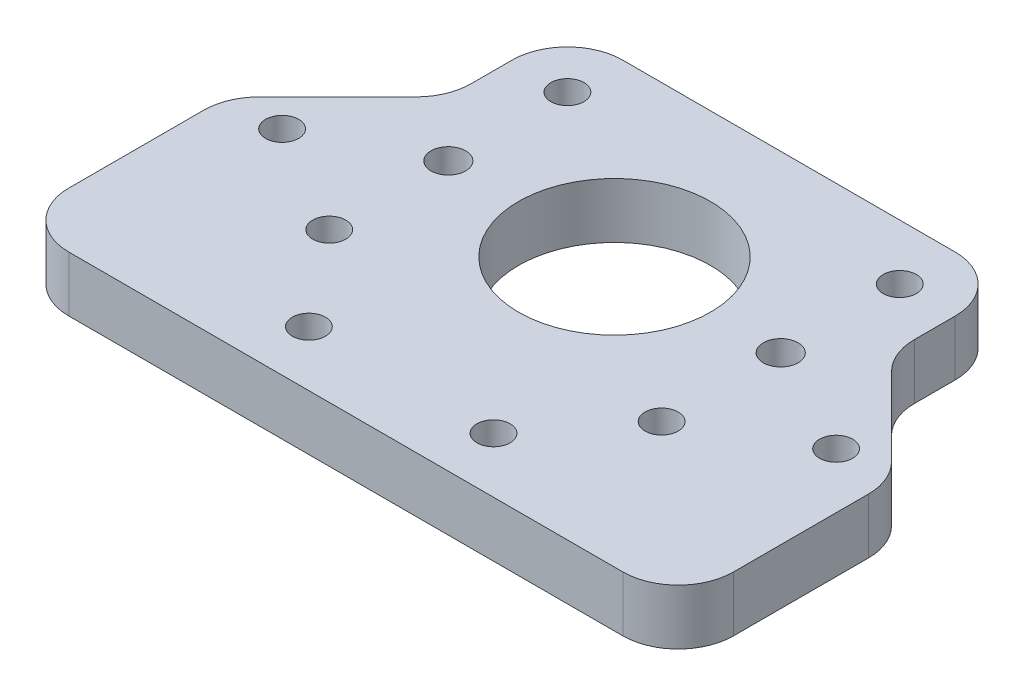
ISO-10303-21;
HEADER;
FILE_DESCRIPTION(('STEP AP214'),'2;1');
FILE_NAME('part.step','',(''),(''),'','','');
FILE_SCHEMA(('AUTOMOTIVE_DESIGN { 1 0 10303 214 1 1 1 1 }'));
ENDSEC;
DATA;
#1=APPLICATION_CONTEXT('core data for automotive mechanical design processes');
#2=APPLICATION_PROTOCOL_DEFINITION('international standard','automotive_design',2000,#1);
#3=PRODUCT_CONTEXT('',#1,'mechanical');
#4=PRODUCT('Part','Part','',(#3));
#5=PRODUCT_RELATED_PRODUCT_CATEGORY('part','',(#4));
#6=PRODUCT_DEFINITION_FORMATION('','',#4);
#7=PRODUCT_DEFINITION_CONTEXT('part definition',#1,'design');
#8=PRODUCT_DEFINITION('design','',#6,#7);
#9=PRODUCT_DEFINITION_SHAPE('','',#8);
#10=(LENGTH_UNIT() NAMED_UNIT(*) SI_UNIT(.MILLI.,.METRE.));
#11=(NAMED_UNIT(*) PLANE_ANGLE_UNIT() SI_UNIT($,.RADIAN.));
#12=(NAMED_UNIT(*) SI_UNIT($,.STERADIAN.) SOLID_ANGLE_UNIT());
#13=UNCERTAINTY_MEASURE_WITH_UNIT(LENGTH_MEASURE(1.E-05),#10,'distance_accuracy_value','');
#14=(GEOMETRIC_REPRESENTATION_CONTEXT(3) GLOBAL_UNCERTAINTY_ASSIGNED_CONTEXT((#13)) GLOBAL_UNIT_ASSIGNED_CONTEXT((#10,
#11,#12)) REPRESENTATION_CONTEXT('',''));
#15=CARTESIAN_POINT('',(0.,0.,0.));
#16=DIRECTION('',(0.,0.,1.));
#17=DIRECTION('',(1.,0.,0.));
#18=AXIS2_PLACEMENT_3D('',#15,#16,#17);
#19=CARTESIAN_POINT('',(0.,6.35,-50.8));
#20=DIRECTION('',(0.,-1.,0.));
#21=DIRECTION('',(0.,0.,-1.));
#22=AXIS2_PLACEMENT_3D('',#19,#20,#21);
#23=PLANE('',#22);
#24=CARTESIAN_POINT('',(6.34999999999999,6.35,-24.45004));
#25=DIRECTION('',(0.,-1.,0.));
#26=DIRECTION('',(0.,0.,-1.));
#27=AXIS2_PLACEMENT_3D('',#24,#25,#26);
#28=CIRCLE('',#27,1.89865);
#29=CARTESIAN_POINT('',(6.34999999999999,6.35,-26.34869));
#30=VERTEX_POINT('',#29);
#31=EDGE_CURVE('E188',#30,#30,#28,.T.);
#32=ORIENTED_EDGE('',*,*,#31,.T.);
#33=EDGE_LOOP('',(#32));
#34=FACE_BOUND('',#33,.T.);
#35=CARTESIAN_POINT('',(27.5166666666667,6.35,-6.35));
#36=DIRECTION('',(0.,-1.,0.));
#37=DIRECTION('',(0.,0.,-1.));
#38=AXIS2_PLACEMENT_3D('',#35,#36,#37);
#39=CIRCLE('',#38,1.89865);
#40=CARTESIAN_POINT('',(27.5166666666667,6.35,-8.24865));
#41=VERTEX_POINT('',#40);
#42=EDGE_CURVE('E195',#41,#41,#39,.T.);
#43=ORIENTED_EDGE('',*,*,#42,.T.);
#44=EDGE_LOOP('',(#43));
#45=FACE_BOUND('',#44,.T.);
#46=CARTESIAN_POINT('',(48.6833333333333,6.35,-6.35));
#47=DIRECTION('',(0.,-1.,0.));
#48=DIRECTION('',(0.,0.,-1.));
#49=AXIS2_PLACEMENT_3D('',#46,#47,#48);
#50=CIRCLE('',#49,1.89865);
#51=CARTESIAN_POINT('',(48.6833333333333,6.35,-8.24865));
#52=VERTEX_POINT('',#51);
#53=EDGE_CURVE('E201',#52,#52,#50,.T.);
#54=ORIENTED_EDGE('',*,*,#53,.T.);
#55=EDGE_LOOP('',(#54));
#56=FACE_BOUND('',#55,.T.);
#57=CARTESIAN_POINT('',(69.85,6.35,-24.45004));
#58=DIRECTION('',(0.,-1.,0.));
#59=DIRECTION('',(0.,0.,-1.));
#60=AXIS2_PLACEMENT_3D('',#57,#58,#59);
#61=CIRCLE('',#60,1.89865000000001);
#62=CARTESIAN_POINT('',(69.85,6.35,-26.34869));
#63=VERTEX_POINT('',#62);
#64=EDGE_CURVE('E207',#63,#63,#61,.T.);
#65=ORIENTED_EDGE('',*,*,#64,.T.);
#66=EDGE_LOOP('',(#65));
#67=FACE_BOUND('',#66,.T.);
#68=CARTESIAN_POINT('',(57.15,6.35,-17.15));
#69=DIRECTION('',(0.,-1.,0.));
#70=DIRECTION('',(0.,0.,-1.));
#71=AXIS2_PLACEMENT_3D('',#68,#69,#70);
#72=CIRCLE('',#71,1.89865);
#73=CARTESIAN_POINT('',(57.15,6.35,-19.04865));
#74=VERTEX_POINT('',#73);
#75=EDGE_CURVE('E213',#74,#74,#72,.T.);
#76=ORIENTED_EDGE('',*,*,#75,.T.);
#77=EDGE_LOOP('',(#76));
#78=FACE_BOUND('',#77,.T.);
#79=CARTESIAN_POINT('',(19.05,6.35,-17.15));
#80=DIRECTION('',(0.,-1.,0.));
#81=DIRECTION('',(0.,0.,-1.));
#82=AXIS2_PLACEMENT_3D('',#79,#80,#81);
#83=CIRCLE('',#82,1.89865);
#84=CARTESIAN_POINT('',(19.05,6.35,-19.04865));
#85=VERTEX_POINT('',#84);
#86=EDGE_CURVE('E219',#85,#85,#83,.T.);
#87=ORIENTED_EDGE('',*,*,#86,.T.);
#88=EDGE_LOOP('',(#87));
#89=FACE_BOUND('',#88,.T.);
#90=CARTESIAN_POINT('',(19.05,6.35,-44.45));
#91=DIRECTION('',(0.,-1.,0.));
#92=DIRECTION('',(0.,0.,-1.));
#93=AXIS2_PLACEMENT_3D('',#90,#91,#92);
#94=CIRCLE('',#93,1.89865);
#95=CARTESIAN_POINT('',(19.05,6.35,-46.34865));
#96=VERTEX_POINT('',#95);
#97=EDGE_CURVE('E225',#96,#96,#94,.T.);
#98=ORIENTED_EDGE('',*,*,#97,.T.);
#99=EDGE_LOOP('',(#98));
#100=FACE_BOUND('',#99,.T.);
#101=CARTESIAN_POINT('',(57.15,6.35,-44.45));
#102=DIRECTION('',(0.,-1.,0.));
#103=DIRECTION('',(0.,0.,-1.));
#104=AXIS2_PLACEMENT_3D('',#101,#102,#103);
#105=CIRCLE('',#104,1.89865);
#106=CARTESIAN_POINT('',(57.15,6.35,-46.34865));
#107=VERTEX_POINT('',#106);
#108=EDGE_CURVE('E231',#107,#107,#105,.T.);
#109=ORIENTED_EDGE('',*,*,#108,.T.);
#110=EDGE_LOOP('',(#109));
#111=FACE_BOUND('',#110,.T.);
#112=CARTESIAN_POINT('',(57.15,6.35,-30.8));
#113=DIRECTION('',(0.,1.,0.));
#114=DIRECTION('',(0.,0.,-1.));
#115=AXIS2_PLACEMENT_3D('',#112,#113,#114);
#116=CIRCLE('',#115,1.9939);
#117=CARTESIAN_POINT('',(57.15,6.35,-32.7939));
#118=VERTEX_POINT('',#117);
#119=EDGE_CURVE('E234',#118,#118,#116,.T.);
#120=ORIENTED_EDGE('',*,*,#119,.F.);
#121=EDGE_LOOP('',(#120));
#122=FACE_BOUND('',#121,.T.);
#123=CARTESIAN_POINT('',(19.05,6.35,-30.8));
#124=DIRECTION('',(0.,1.,0.));
#125=DIRECTION('',(0.,0.,1.));
#126=AXIS2_PLACEMENT_3D('',#123,#124,#125);
#127=CIRCLE('',#126,1.9939);
#128=CARTESIAN_POINT('',(19.05,6.35,-28.8061));
#129=VERTEX_POINT('',#128);
#130=EDGE_CURVE('E240',#129,#129,#127,.T.);
#131=ORIENTED_EDGE('',*,*,#130,.F.);
#132=EDGE_LOOP('',(#131));
#133=FACE_BOUND('',#132,.T.);
#134=DIRECTION('',(0.707106781186549,0.,-0.707106781186546));
#135=VECTOR('',#134,1.);
#136=CARTESIAN_POINT('',(12.7,6.35,-37.15));
#137=LINE('',#136,#135);
#138=CARTESIAN_POINT('',(1.85987193946543,6.35,-26.3098719394655));
#139=VERTEX_POINT('',#138);
#140=CARTESIAN_POINT('',(10.8401280605346,6.35,-35.2901280605346));
#141=VERTEX_POINT('',#140);
#142=EDGE_CURVE('E166',#139,#141,#137,.T.);
#143=ORIENTED_EDGE('',*,*,#142,.F.);
#144=CARTESIAN_POINT('',(6.35,6.35,-21.8197438789309));
#145=DIRECTION('',(0.,-1.,0.));
#146=DIRECTION('',(0.,0.,-1.));
#147=AXIS2_PLACEMENT_3D('',#144,#145,#146);
#148=CIRCLE('',#147,6.35);
#149=CARTESIAN_POINT('',(0.,6.35,-21.8197438789309));
#150=VERTEX_POINT('',#149);
#151=EDGE_CURVE('E149',#139,#150,#148,.F.);
#152=ORIENTED_EDGE('',*,*,#151,.T.);
#153=DIRECTION('',(0.,0.,1.));
#154=VECTOR('',#153,1.);
#155=CARTESIAN_POINT('',(0.,6.35,0.));
#156=LINE('',#155,#154);
#157=CARTESIAN_POINT('',(0.,6.35,-6.35));
#158=VERTEX_POINT('',#157);
#159=EDGE_CURVE('E255',#150,#158,#156,.T.);
#160=ORIENTED_EDGE('',*,*,#159,.T.);
#161=CARTESIAN_POINT('',(6.35,6.35,-6.35));
#162=DIRECTION('',(0.,-1.,0.));
#163=DIRECTION('',(0.,0.,-1.));
#164=AXIS2_PLACEMENT_3D('',#161,#162,#163);
#165=CIRCLE('',#164,6.35);
#166=CARTESIAN_POINT('',(6.35,6.35,0.));
#167=VERTEX_POINT('',#166);
#168=EDGE_CURVE('E170',#158,#167,#165,.F.);
#169=ORIENTED_EDGE('',*,*,#168,.T.);
#170=DIRECTION('',(1.,0.,0.));
#171=VECTOR('',#170,1.);
#172=CARTESIAN_POINT('',(0.,6.35,0.));
#173=LINE('',#172,#171);
#174=CARTESIAN_POINT('',(69.85,6.35,0.));
#175=VERTEX_POINT('',#174);
#176=EDGE_CURVE('E257',#167,#175,#173,.T.);
#177=ORIENTED_EDGE('',*,*,#176,.T.);
#178=CARTESIAN_POINT('',(69.85,6.35,-6.35));
#179=DIRECTION('',(0.,-1.,0.));
#180=DIRECTION('',(0.,0.,-1.));
#181=AXIS2_PLACEMENT_3D('',#178,#179,#180);
#182=CIRCLE('',#181,6.35);
#183=CARTESIAN_POINT('',(76.2,6.35,-6.35));
#184=VERTEX_POINT('',#183);
#185=EDGE_CURVE('E279',#175,#184,#182,.F.);
#186=ORIENTED_EDGE('',*,*,#185,.T.);
#187=DIRECTION('',(0.,0.,-1.));
#188=VECTOR('',#187,1.);
#189=CARTESIAN_POINT('',(76.2,6.35,-50.8));
#190=LINE('',#189,#188);
#191=CARTESIAN_POINT('',(76.2,6.35,-21.8197438789309));
#192=VERTEX_POINT('',#191);
#193=EDGE_CURVE('E261',#184,#192,#190,.T.);
#194=ORIENTED_EDGE('',*,*,#193,.T.);
#195=CARTESIAN_POINT('',(69.85,6.35,-21.8197438789309));
#196=DIRECTION('',(0.,-1.,0.));
#197=DIRECTION('',(0.,0.,-1.));
#198=AXIS2_PLACEMENT_3D('',#195,#196,#197);
#199=CIRCLE('',#198,6.35);
#200=CARTESIAN_POINT('',(74.3401280605346,6.35,-26.3098719394655));
#201=VERTEX_POINT('',#200);
#202=EDGE_CURVE('E160',#192,#201,#199,.F.);
#203=ORIENTED_EDGE('',*,*,#202,.T.);
#204=DIRECTION('',(0.707106781186549,0.,0.707106781186546));
#205=VECTOR('',#204,1.);
#206=CARTESIAN_POINT('',(76.2,6.35,-24.4500000000001));
#207=LINE('',#206,#205);
#208=CARTESIAN_POINT('',(65.3598719394654,6.35,-35.2901280605346));
#209=VERTEX_POINT('',#208);
#210=EDGE_CURVE('E335',#209,#201,#207,.T.);
#211=ORIENTED_EDGE('',*,*,#210,.F.);
#212=CARTESIAN_POINT('',(69.85,6.35,-39.7802561210692));
#213=DIRECTION('',(0.,-1.,0.));
#214=DIRECTION('',(0.,0.,-1.));
#215=AXIS2_PLACEMENT_3D('',#212,#213,#214);
#216=CIRCLE('',#215,6.35);
#217=CARTESIAN_POINT('',(63.5,6.35,-39.7802561210692));
#218=VERTEX_POINT('',#217);
#219=EDGE_CURVE('E43',#209,#218,#216,.T.);
#220=ORIENTED_EDGE('',*,*,#219,.T.);
#221=DIRECTION('',(0.,0.,1.));
#222=VECTOR('',#221,1.);
#223=CARTESIAN_POINT('',(63.5,6.35,-50.8));
#224=LINE('',#223,#222);
#225=CARTESIAN_POINT('',(63.5,6.35,-44.45));
#226=VERTEX_POINT('',#225);
#227=EDGE_CURVE('E333',#226,#218,#224,.T.);
#228=ORIENTED_EDGE('',*,*,#227,.F.);
#229=CARTESIAN_POINT('',(57.15,6.35,-44.45));
#230=DIRECTION('',(0.,-1.,0.));
#231=DIRECTION('',(0.,0.,-1.));
#232=AXIS2_PLACEMENT_3D('',#229,#230,#231);
#233=CIRCLE('',#232,6.35);
#234=CARTESIAN_POINT('',(57.15,6.35,-50.8));
#235=VERTEX_POINT('',#234);
#236=EDGE_CURVE('E283',#226,#235,#233,.F.);
#237=ORIENTED_EDGE('',*,*,#236,.T.);
#238=DIRECTION('',(-1.,0.,0.));
#239=VECTOR('',#238,1.);
#240=CARTESIAN_POINT('',(38.1,6.35,-50.8));
#241=LINE('',#240,#239);
#242=CARTESIAN_POINT('',(19.05,6.35,-50.8));
#243=VERTEX_POINT('',#242);
#244=EDGE_CURVE('E264',#235,#243,#241,.T.);
#245=ORIENTED_EDGE('',*,*,#244,.T.);
#246=CARTESIAN_POINT('',(19.05,6.35,-44.45));
#247=DIRECTION('',(0.,-1.,0.));
#248=DIRECTION('',(0.,0.,-1.));
#249=AXIS2_PLACEMENT_3D('',#246,#247,#248);
#250=CIRCLE('',#249,6.35);
#251=CARTESIAN_POINT('',(12.7,6.35,-44.45));
#252=VERTEX_POINT('',#251);
#253=EDGE_CURVE('E281',#243,#252,#250,.F.);
#254=ORIENTED_EDGE('',*,*,#253,.T.);
#255=DIRECTION('',(0.,0.,-1.));
#256=VECTOR('',#255,1.);
#257=CARTESIAN_POINT('',(12.7,6.35,-50.8));
#258=LINE('',#257,#256);
#259=CARTESIAN_POINT('',(12.7,6.35,-39.7802561210692));
#260=VERTEX_POINT('',#259);
#261=EDGE_CURVE('E176',#260,#252,#258,.T.);
#262=ORIENTED_EDGE('',*,*,#261,.F.);
#263=CARTESIAN_POINT('',(6.35,6.35,-39.7802561210692));
#264=DIRECTION('',(0.,-1.,0.));
#265=DIRECTION('',(0.,0.,-1.));
#266=AXIS2_PLACEMENT_3D('',#263,#264,#265);
#267=CIRCLE('',#266,6.35);
#268=EDGE_CURVE('E175',#260,#141,#267,.T.);
#269=ORIENTED_EDGE('',*,*,#268,.T.);
#270=EDGE_LOOP('',(#143,#152,#160,#169,#177,#186,#194,#203,#211,#220,#228,#237,#245,#254,#262,#269));
#271=FACE_BOUND('',#270,.T.);
#272=CARTESIAN_POINT('',(38.1,6.35,-30.8));
#273=DIRECTION('',(0.,1.,0.));
#274=DIRECTION('',(0.,0.,1.));
#275=AXIS2_PLACEMENT_3D('',#272,#273,#274);
#276=CIRCLE('',#275,11.);
#277=CARTESIAN_POINT('',(38.1,6.35,-19.8));
#278=VERTEX_POINT('',#277);
#279=EDGE_CURVE('E249',#278,#278,#276,.T.);
#280=ORIENTED_EDGE('',*,*,#279,.F.);
#281=EDGE_LOOP('',(#280));
#282=FACE_BOUND('',#281,.T.);
#283=ADVANCED_FACE('F35',(#34,#45,#56,#67,#78,#89,#100,#111,#122,#133,#271,#282),#23,.F.);
#284=CARTESIAN_POINT('',(0.,0.,-50.8));
#285=DIRECTION('',(0.,-1.,0.));
#286=DIRECTION('',(0.,0.,-1.));
#287=AXIS2_PLACEMENT_3D('',#284,#285,#286);
#288=PLANE('',#287);
#289=DIRECTION('',(0.,0.,1.));
#290=VECTOR('',#289,1.);
#291=CARTESIAN_POINT('',(0.,0.,0.));
#292=LINE('',#291,#290);
#293=CARTESIAN_POINT('',(0.,0.,-21.8197438789309));
#294=VERTEX_POINT('',#293);
#295=CARTESIAN_POINT('',(0.,0.,-6.35));
#296=VERTEX_POINT('',#295);
#297=EDGE_CURVE('E252',#294,#296,#292,.T.);
#298=ORIENTED_EDGE('',*,*,#297,.F.);
#299=CARTESIAN_POINT('',(6.35,0.,-21.8197438789309));
#300=DIRECTION('',(0.,-1.,0.));
#301=DIRECTION('',(0.,0.,-1.));
#302=AXIS2_PLACEMENT_3D('',#299,#300,#301);
#303=CIRCLE('',#302,6.35);
#304=CARTESIAN_POINT('',(1.85987193946543,0.,-26.3098719394655));
#305=VERTEX_POINT('',#304);
#306=EDGE_CURVE('E297',#294,#305,#303,.T.);
#307=ORIENTED_EDGE('',*,*,#306,.T.);
#308=DIRECTION('',(0.707106781186549,0.,-0.707106781186546));
#309=VECTOR('',#308,1.);
#310=CARTESIAN_POINT('',(12.7,0.,-37.15));
#311=LINE('',#310,#309);
#312=CARTESIAN_POINT('',(10.8401280605346,0.,-35.2901280605346));
#313=VERTEX_POINT('',#312);
#314=EDGE_CURVE('E169',#305,#313,#311,.T.);
#315=ORIENTED_EDGE('',*,*,#314,.T.);
#316=CARTESIAN_POINT('',(6.35,0.,-39.7802561210692));
#317=DIRECTION('',(0.,-1.,0.));
#318=DIRECTION('',(0.,0.,-1.));
#319=AXIS2_PLACEMENT_3D('',#316,#317,#318);
#320=CIRCLE('',#319,6.35);
#321=CARTESIAN_POINT('',(12.7,0.,-39.7802561210692));
#322=VERTEX_POINT('',#321);
#323=EDGE_CURVE('E330',#313,#322,#320,.F.);
#324=ORIENTED_EDGE('',*,*,#323,.T.);
#325=DIRECTION('',(0.,0.,-1.));
#326=VECTOR('',#325,1.);
#327=CARTESIAN_POINT('',(12.7,0.,-50.8));
#328=LINE('',#327,#326);
#329=CARTESIAN_POINT('',(12.7,0.,-44.45));
#330=VERTEX_POINT('',#329);
#331=EDGE_CURVE('E185',#322,#330,#328,.T.);
#332=ORIENTED_EDGE('',*,*,#331,.T.);
#333=CARTESIAN_POINT('',(19.05,0.,-44.45));
#334=DIRECTION('',(0.,-1.,0.));
#335=DIRECTION('',(0.,0.,-1.));
#336=AXIS2_PLACEMENT_3D('',#333,#334,#335);
#337=CIRCLE('',#336,6.35);
#338=CARTESIAN_POINT('',(19.05,0.,-50.8));
#339=VERTEX_POINT('',#338);
#340=EDGE_CURVE('E292',#330,#339,#337,.T.);
#341=ORIENTED_EDGE('',*,*,#340,.T.);
#342=DIRECTION('',(-1.,0.,0.));
#343=VECTOR('',#342,1.);
#344=CARTESIAN_POINT('',(0.,0.,-50.8));
#345=LINE('',#344,#343);
#346=CARTESIAN_POINT('',(57.15,0.,-50.8));
#347=VERTEX_POINT('',#346);
#348=EDGE_CURVE('E258',#347,#339,#345,.T.);
#349=ORIENTED_EDGE('',*,*,#348,.F.);
#350=CARTESIAN_POINT('',(57.15,0.,-44.45));
#351=DIRECTION('',(0.,-1.,0.));
#352=DIRECTION('',(0.,0.,-1.));
#353=AXIS2_PLACEMENT_3D('',#350,#351,#352);
#354=CIRCLE('',#353,6.35);
#355=CARTESIAN_POINT('',(63.5,0.,-44.45));
#356=VERTEX_POINT('',#355);
#357=EDGE_CURVE('E57',#347,#356,#354,.T.);
#358=ORIENTED_EDGE('',*,*,#357,.T.);
#359=DIRECTION('',(0.,0.,1.));
#360=VECTOR('',#359,1.);
#361=CARTESIAN_POINT('',(63.5,0.,-50.8));
#362=LINE('',#361,#360);
#363=CARTESIAN_POINT('',(63.5,0.,-39.7802561210692));
#364=VERTEX_POINT('',#363);
#365=EDGE_CURVE('E182',#356,#364,#362,.T.);
#366=ORIENTED_EDGE('',*,*,#365,.T.);
#367=CARTESIAN_POINT('',(69.85,0.,-39.7802561210692));
#368=DIRECTION('',(0.,-1.,0.));
#369=DIRECTION('',(0.,0.,-1.));
#370=AXIS2_PLACEMENT_3D('',#367,#368,#369);
#371=CIRCLE('',#370,6.35);
#372=CARTESIAN_POINT('',(65.3598719394654,0.,-35.2901280605346));
#373=VERTEX_POINT('',#372);
#374=EDGE_CURVE('E11',#364,#373,#371,.F.);
#375=ORIENTED_EDGE('',*,*,#374,.T.);
#376=DIRECTION('',(0.707106781186549,0.,0.707106781186546));
#377=VECTOR('',#376,1.);
#378=CARTESIAN_POINT('',(76.2,0.,-24.4500000000001));
#379=LINE('',#378,#377);
#380=CARTESIAN_POINT('',(74.3401280605346,0.,-26.3098719394655));
#381=VERTEX_POINT('',#380);
#382=EDGE_CURVE('E177',#373,#381,#379,.T.);
#383=ORIENTED_EDGE('',*,*,#382,.T.);
#384=CARTESIAN_POINT('',(69.85,0.,-21.8197438789309));
#385=DIRECTION('',(0.,-1.,0.));
#386=DIRECTION('',(0.,0.,-1.));
#387=AXIS2_PLACEMENT_3D('',#384,#385,#386);
#388=CIRCLE('',#387,6.35);
#389=CARTESIAN_POINT('',(76.2,0.,-21.8197438789309));
#390=VERTEX_POINT('',#389);
#391=EDGE_CURVE('E295',#381,#390,#388,.T.);
#392=ORIENTED_EDGE('',*,*,#391,.T.);
#393=DIRECTION('',(0.,0.,-1.));
#394=VECTOR('',#393,1.);
#395=CARTESIAN_POINT('',(76.2,0.,-50.8));
#396=LINE('',#395,#394);
#397=CARTESIAN_POINT('',(76.2,0.,-6.35));
#398=VERTEX_POINT('',#397);
#399=EDGE_CURVE('E272',#398,#390,#396,.T.);
#400=ORIENTED_EDGE('',*,*,#399,.F.);
#401=CARTESIAN_POINT('',(69.85,0.,-6.35));
#402=DIRECTION('',(0.,-1.,0.));
#403=DIRECTION('',(0.,0.,-1.));
#404=AXIS2_PLACEMENT_3D('',#401,#402,#403);
#405=CIRCLE('',#404,6.35);
#406=CARTESIAN_POINT('',(69.85,0.,0.));
#407=VERTEX_POINT('',#406);
#408=EDGE_CURVE('E290',#398,#407,#405,.T.);
#409=ORIENTED_EDGE('',*,*,#408,.T.);
#410=DIRECTION('',(1.,0.,0.));
#411=VECTOR('',#410,1.);
#412=CARTESIAN_POINT('',(0.,0.,0.));
#413=LINE('',#412,#411);
#414=CARTESIAN_POINT('',(6.35,0.,0.));
#415=VERTEX_POINT('',#414);
#416=EDGE_CURVE('E269',#415,#407,#413,.T.);
#417=ORIENTED_EDGE('',*,*,#416,.F.);
#418=CARTESIAN_POINT('',(6.35,0.,-6.35));
#419=DIRECTION('',(0.,-1.,0.));
#420=DIRECTION('',(0.,0.,-1.));
#421=AXIS2_PLACEMENT_3D('',#418,#419,#420);
#422=CIRCLE('',#421,6.35);
#423=EDGE_CURVE('E288',#415,#296,#422,.T.);
#424=ORIENTED_EDGE('',*,*,#423,.T.);
#425=EDGE_LOOP('',(#298,#307,#315,#324,#332,#341,#349,#358,#366,#375,#383,#392,#400,#409,#417,#424));
#426=FACE_BOUND('',#425,.T.);
#427=CARTESIAN_POINT('',(6.34999999999999,0.,-24.45004));
#428=DIRECTION('',(0.,-1.,0.));
#429=DIRECTION('',(0.,0.,-1.));
#430=AXIS2_PLACEMENT_3D('',#427,#428,#429);
#431=CIRCLE('',#430,1.89865);
#432=CARTESIAN_POINT('',(6.34999999999999,0.,-26.34869));
#433=VERTEX_POINT('',#432);
#434=EDGE_CURVE('E192',#433,#433,#431,.T.);
#435=ORIENTED_EDGE('',*,*,#434,.F.);
#436=EDGE_LOOP('',(#435));
#437=FACE_BOUND('',#436,.T.);
#438=CARTESIAN_POINT('',(27.5166666666667,0.,-6.35));
#439=DIRECTION('',(0.,-1.,0.));
#440=DIRECTION('',(0.,0.,-1.));
#441=AXIS2_PLACEMENT_3D('',#438,#439,#440);
#442=CIRCLE('',#441,1.89865);
#443=CARTESIAN_POINT('',(27.5166666666667,0.,-8.24865));
#444=VERTEX_POINT('',#443);
#445=EDGE_CURVE('E191',#444,#444,#442,.T.);
#446=ORIENTED_EDGE('',*,*,#445,.F.);
#447=EDGE_LOOP('',(#446));
#448=FACE_BOUND('',#447,.T.);
#449=CARTESIAN_POINT('',(48.6833333333333,0.,-6.35));
#450=DIRECTION('',(0.,-1.,0.));
#451=DIRECTION('',(0.,0.,-1.));
#452=AXIS2_PLACEMENT_3D('',#449,#450,#451);
#453=CIRCLE('',#452,1.89865);
#454=CARTESIAN_POINT('',(48.6833333333333,0.,-8.24865));
#455=VERTEX_POINT('',#454);
#456=EDGE_CURVE('E198',#455,#455,#453,.T.);
#457=ORIENTED_EDGE('',*,*,#456,.F.);
#458=EDGE_LOOP('',(#457));
#459=FACE_BOUND('',#458,.T.);
#460=CARTESIAN_POINT('',(69.85,0.,-24.45004));
#461=DIRECTION('',(0.,-1.,0.));
#462=DIRECTION('',(0.,0.,-1.));
#463=AXIS2_PLACEMENT_3D('',#460,#461,#462);
#464=CIRCLE('',#463,1.89865000000001);
#465=CARTESIAN_POINT('',(69.85,0.,-26.34869));
#466=VERTEX_POINT('',#465);
#467=EDGE_CURVE('E204',#466,#466,#464,.T.);
#468=ORIENTED_EDGE('',*,*,#467,.F.);
#469=EDGE_LOOP('',(#468));
#470=FACE_BOUND('',#469,.T.);
#471=CARTESIAN_POINT('',(57.15,0.,-17.15));
#472=DIRECTION('',(0.,-1.,0.));
#473=DIRECTION('',(0.,0.,-1.));
#474=AXIS2_PLACEMENT_3D('',#471,#472,#473);
#475=CIRCLE('',#474,1.89865);
#476=CARTESIAN_POINT('',(57.15,0.,-19.04865));
#477=VERTEX_POINT('',#476);
#478=EDGE_CURVE('E210',#477,#477,#475,.T.);
#479=ORIENTED_EDGE('',*,*,#478,.F.);
#480=EDGE_LOOP('',(#479));
#481=FACE_BOUND('',#480,.T.);
#482=CARTESIAN_POINT('',(19.05,0.,-17.15));
#483=DIRECTION('',(0.,-1.,0.));
#484=DIRECTION('',(0.,0.,-1.));
#485=AXIS2_PLACEMENT_3D('',#482,#483,#484);
#486=CIRCLE('',#485,1.89865);
#487=CARTESIAN_POINT('',(19.05,0.,-19.04865));
#488=VERTEX_POINT('',#487);
#489=EDGE_CURVE('E216',#488,#488,#486,.T.);
#490=ORIENTED_EDGE('',*,*,#489,.F.);
#491=EDGE_LOOP('',(#490));
#492=FACE_BOUND('',#491,.T.);
#493=CARTESIAN_POINT('',(19.05,0.,-44.45));
#494=DIRECTION('',(0.,-1.,0.));
#495=DIRECTION('',(0.,0.,-1.));
#496=AXIS2_PLACEMENT_3D('',#493,#494,#495);
#497=CIRCLE('',#496,1.89865);
#498=CARTESIAN_POINT('',(19.05,0.,-46.34865));
#499=VERTEX_POINT('',#498);
#500=EDGE_CURVE('E222',#499,#499,#497,.T.);
#501=ORIENTED_EDGE('',*,*,#500,.F.);
#502=EDGE_LOOP('',(#501));
#503=FACE_BOUND('',#502,.T.);
#504=CARTESIAN_POINT('',(57.15,0.,-44.45));
#505=DIRECTION('',(0.,-1.,0.));
#506=DIRECTION('',(0.,0.,-1.));
#507=AXIS2_PLACEMENT_3D('',#504,#505,#506);
#508=CIRCLE('',#507,1.89865);
#509=CARTESIAN_POINT('',(57.15,0.,-46.34865));
#510=VERTEX_POINT('',#509);
#511=EDGE_CURVE('E228',#510,#510,#508,.T.);
#512=ORIENTED_EDGE('',*,*,#511,.F.);
#513=EDGE_LOOP('',(#512));
#514=FACE_BOUND('',#513,.T.);
#515=CARTESIAN_POINT('',(57.15,0.,-30.8));
#516=DIRECTION('',(0.,1.,0.));
#517=DIRECTION('',(0.,0.,-1.));
#518=AXIS2_PLACEMENT_3D('',#515,#516,#517);
#519=CIRCLE('',#518,1.9939);
#520=CARTESIAN_POINT('',(57.15,0.,-32.7939));
#521=VERTEX_POINT('',#520);
#522=EDGE_CURVE('E237',#521,#521,#519,.T.);
#523=ORIENTED_EDGE('',*,*,#522,.T.);
#524=EDGE_LOOP('',(#523));
#525=FACE_BOUND('',#524,.T.);
#526=CARTESIAN_POINT('',(19.05,0.,-30.8));
#527=DIRECTION('',(0.,1.,0.));
#528=DIRECTION('',(0.,0.,1.));
#529=AXIS2_PLACEMENT_3D('',#526,#527,#528);
#530=CIRCLE('',#529,1.9939);
#531=CARTESIAN_POINT('',(19.05,0.,-28.8061));
#532=VERTEX_POINT('',#531);
#533=EDGE_CURVE('E243',#532,#532,#530,.T.);
#534=ORIENTED_EDGE('',*,*,#533,.T.);
#535=EDGE_LOOP('',(#534));
#536=FACE_BOUND('',#535,.T.);
#537=CARTESIAN_POINT('',(38.1,0.,-30.8));
#538=DIRECTION('',(0.,1.,0.));
#539=DIRECTION('',(0.,0.,1.));
#540=AXIS2_PLACEMENT_3D('',#537,#538,#539);
#541=CIRCLE('',#540,11.);
#542=CARTESIAN_POINT('',(38.1,0.,-19.8));
#543=VERTEX_POINT('',#542);
#544=EDGE_CURVE('E246',#543,#543,#541,.T.);
#545=ORIENTED_EDGE('',*,*,#544,.T.);
#546=EDGE_LOOP('',(#545));
#547=FACE_BOUND('',#546,.T.);
#548=ADVANCED_FACE('F345',(#426,#437,#448,#459,#470,#481,#492,#503,#514,#525,#536,#547),#288,.T.);
#549=CARTESIAN_POINT('',(0.,6.35,0.));
#550=DIRECTION('',(1.,0.,0.));
#551=DIRECTION('',(0.,0.,-1.));
#552=AXIS2_PLACEMENT_3D('',#549,#550,#551);
#553=PLANE('',#552);
#554=ORIENTED_EDGE('',*,*,#159,.F.);
#555=DIRECTION('',(0.,1.,0.));
#556=VECTOR('',#555,1.);
#557=CARTESIAN_POINT('',(0.,6.35,-21.8197438789309));
#558=LINE('',#557,#556);
#559=EDGE_CURVE('E154',#150,#294,#558,.F.);
#560=ORIENTED_EDGE('',*,*,#559,.T.);
#561=ORIENTED_EDGE('',*,*,#297,.T.);
#562=DIRECTION('',(0.,-1.,0.));
#563=VECTOR('',#562,1.);
#564=CARTESIAN_POINT('',(0.,6.35,-6.35));
#565=LINE('',#564,#563);
#566=EDGE_CURVE('E159',#296,#158,#565,.F.);
#567=ORIENTED_EDGE('',*,*,#566,.T.);
#568=EDGE_LOOP('',(#554,#560,#561,#567));
#569=FACE_BOUND('',#568,.T.);
#570=ADVANCED_FACE('F372',(#569),#553,.F.);
#571=CARTESIAN_POINT('',(0.,6.35,0.));
#572=DIRECTION('',(0.,0.,-1.));
#573=DIRECTION('',(-1.,0.,0.));
#574=AXIS2_PLACEMENT_3D('',#571,#572,#573);
#575=PLANE('',#574);
#576=ORIENTED_EDGE('',*,*,#416,.T.);
#577=DIRECTION('',(0.,-1.,0.));
#578=VECTOR('',#577,1.);
#579=CARTESIAN_POINT('',(69.85,6.35,0.));
#580=LINE('',#579,#578);
#581=EDGE_CURVE('E327',#407,#175,#580,.F.);
#582=ORIENTED_EDGE('',*,*,#581,.T.);
#583=ORIENTED_EDGE('',*,*,#176,.F.);
#584=DIRECTION('',(0.,-1.,0.));
#585=VECTOR('',#584,1.);
#586=CARTESIAN_POINT('',(6.35,6.35,0.));
#587=LINE('',#586,#585);
#588=EDGE_CURVE('E324',#167,#415,#587,.T.);
#589=ORIENTED_EDGE('',*,*,#588,.T.);
#590=EDGE_LOOP('',(#576,#582,#583,#589));
#591=FACE_BOUND('',#590,.T.);
#592=ADVANCED_FACE('F365',(#591),#575,.F.);
#593=CARTESIAN_POINT('',(76.2,6.35,-50.8));
#594=DIRECTION('',(-1.,0.,0.));
#595=DIRECTION('',(0.,0.,1.));
#596=AXIS2_PLACEMENT_3D('',#593,#594,#595);
#597=PLANE('',#596);
#598=ORIENTED_EDGE('',*,*,#399,.T.);
#599=DIRECTION('',(0.,1.,0.));
#600=VECTOR('',#599,1.);
#601=CARTESIAN_POINT('',(76.2,6.35,-21.8197438789309));
#602=LINE('',#601,#600);
#603=EDGE_CURVE('E307',#390,#192,#602,.T.);
#604=ORIENTED_EDGE('',*,*,#603,.T.);
#605=ORIENTED_EDGE('',*,*,#193,.F.);
#606=DIRECTION('',(0.,-1.,0.));
#607=VECTOR('',#606,1.);
#608=CARTESIAN_POINT('',(76.2,6.35,-6.35));
#609=LINE('',#608,#607);
#610=EDGE_CURVE('E304',#184,#398,#609,.T.);
#611=ORIENTED_EDGE('',*,*,#610,.T.);
#612=EDGE_LOOP('',(#598,#604,#605,#611));
#613=FACE_BOUND('',#612,.T.);
#614=ADVANCED_FACE('F356',(#613),#597,.F.);
#615=CARTESIAN_POINT('',(0.,6.35,-50.8));
#616=DIRECTION('',(0.,0.,1.));
#617=DIRECTION('',(1.,0.,0.));
#618=AXIS2_PLACEMENT_3D('',#615,#616,#617);
#619=PLANE('',#618);
#620=ORIENTED_EDGE('',*,*,#244,.F.);
#621=DIRECTION('',(0.,1.,0.));
#622=VECTOR('',#621,1.);
#623=CARTESIAN_POINT('',(57.15,6.35,-50.8));
#624=LINE('',#623,#622);
#625=EDGE_CURVE('E322',#235,#347,#624,.F.);
#626=ORIENTED_EDGE('',*,*,#625,.T.);
#627=ORIENTED_EDGE('',*,*,#348,.T.);
#628=DIRECTION('',(0.,1.,0.));
#629=VECTOR('',#628,1.);
#630=CARTESIAN_POINT('',(19.05,6.35,-50.8));
#631=LINE('',#630,#629);
#632=EDGE_CURVE('E319',#339,#243,#631,.T.);
#633=ORIENTED_EDGE('',*,*,#632,.T.);
#634=EDGE_LOOP('',(#620,#626,#627,#633));
#635=FACE_BOUND('',#634,.T.);
#636=ADVANCED_FACE('F392',(#635),#619,.F.);
#637=CARTESIAN_POINT('',(38.1,6.35,-30.8));
#638=DIRECTION('',(0.,-1.,0.));
#639=DIRECTION('',(0.,0.,-1.));
#640=AXIS2_PLACEMENT_3D('',#637,#638,#639);
#641=CYLINDRICAL_SURFACE('',#640,11.);
#642=ORIENTED_EDGE('',*,*,#279,.T.);
#643=EDGE_LOOP('',(#642));
#644=FACE_BOUND('',#643,.T.);
#645=ORIENTED_EDGE('',*,*,#544,.F.);
#646=EDGE_LOOP('',(#645));
#647=FACE_BOUND('',#646,.T.);
#648=ADVANCED_FACE('F389',(#644,#647),#641,.F.);
#649=CARTESIAN_POINT('',(19.05,0.,-30.8));
#650=DIRECTION('',(0.,1.,0.));
#651=DIRECTION('',(0.,0.,1.));
#652=AXIS2_PLACEMENT_3D('',#649,#650,#651);
#653=CYLINDRICAL_SURFACE('',#652,1.9939);
#654=ORIENTED_EDGE('',*,*,#533,.F.);
#655=EDGE_LOOP('',(#654));
#656=FACE_BOUND('',#655,.T.);
#657=ORIENTED_EDGE('',*,*,#130,.T.);
#658=EDGE_LOOP('',(#657));
#659=FACE_BOUND('',#658,.T.);
#660=ADVANCED_FACE('F412',(#656,#659),#653,.F.);
#661=CARTESIAN_POINT('',(57.15,0.,-30.8));
#662=DIRECTION('',(0.,1.,0.));
#663=DIRECTION('',(0.,0.,1.));
#664=AXIS2_PLACEMENT_3D('',#661,#662,#663);
#665=CYLINDRICAL_SURFACE('',#664,1.9939);
#666=ORIENTED_EDGE('',*,*,#522,.F.);
#667=EDGE_LOOP('',(#666));
#668=FACE_BOUND('',#667,.T.);
#669=ORIENTED_EDGE('',*,*,#119,.T.);
#670=EDGE_LOOP('',(#669));
#671=FACE_BOUND('',#670,.T.);
#672=ADVANCED_FACE('F419',(#668,#671),#665,.F.);
#673=CARTESIAN_POINT('',(57.15,6.35,-44.45));
#674=DIRECTION('',(0.,-1.,0.));
#675=DIRECTION('',(0.,0.,-1.));
#676=AXIS2_PLACEMENT_3D('',#673,#674,#675);
#677=CYLINDRICAL_SURFACE('',#676,1.89865);
#678=ORIENTED_EDGE('',*,*,#108,.F.);
#679=EDGE_LOOP('',(#678));
#680=FACE_BOUND('',#679,.T.);
#681=ORIENTED_EDGE('',*,*,#511,.T.);
#682=EDGE_LOOP('',(#681));
#683=FACE_BOUND('',#682,.T.);
#684=ADVANCED_FACE('F426',(#680,#683),#677,.F.);
#685=CARTESIAN_POINT('',(19.05,6.35,-44.45));
#686=DIRECTION('',(0.,-1.,0.));
#687=DIRECTION('',(0.,0.,-1.));
#688=AXIS2_PLACEMENT_3D('',#685,#686,#687);
#689=CYLINDRICAL_SURFACE('',#688,1.89865);
#690=ORIENTED_EDGE('',*,*,#97,.F.);
#691=EDGE_LOOP('',(#690));
#692=FACE_BOUND('',#691,.T.);
#693=ORIENTED_EDGE('',*,*,#500,.T.);
#694=EDGE_LOOP('',(#693));
#695=FACE_BOUND('',#694,.T.);
#696=ADVANCED_FACE('F434',(#692,#695),#689,.F.);
#697=CARTESIAN_POINT('',(19.05,6.35,-17.15));
#698=DIRECTION('',(0.,-1.,0.));
#699=DIRECTION('',(0.,0.,-1.));
#700=AXIS2_PLACEMENT_3D('',#697,#698,#699);
#701=CYLINDRICAL_SURFACE('',#700,1.89865);
#702=ORIENTED_EDGE('',*,*,#86,.F.);
#703=EDGE_LOOP('',(#702));
#704=FACE_BOUND('',#703,.T.);
#705=ORIENTED_EDGE('',*,*,#489,.T.);
#706=EDGE_LOOP('',(#705));
#707=FACE_BOUND('',#706,.T.);
#708=ADVANCED_FACE('F442',(#704,#707),#701,.F.);
#709=CARTESIAN_POINT('',(57.15,6.35,-17.15));
#710=DIRECTION('',(0.,-1.,0.));
#711=DIRECTION('',(0.,0.,-1.));
#712=AXIS2_PLACEMENT_3D('',#709,#710,#711);
#713=CYLINDRICAL_SURFACE('',#712,1.89865);
#714=ORIENTED_EDGE('',*,*,#75,.F.);
#715=EDGE_LOOP('',(#714));
#716=FACE_BOUND('',#715,.T.);
#717=ORIENTED_EDGE('',*,*,#478,.T.);
#718=EDGE_LOOP('',(#717));
#719=FACE_BOUND('',#718,.T.);
#720=ADVANCED_FACE('F450',(#716,#719),#713,.F.);
#721=CARTESIAN_POINT('',(69.85,6.35,-24.45004));
#722=DIRECTION('',(0.,-1.,0.));
#723=DIRECTION('',(0.,0.,-1.));
#724=AXIS2_PLACEMENT_3D('',#721,#722,#723);
#725=CYLINDRICAL_SURFACE('',#724,1.89865000000001);
#726=ORIENTED_EDGE('',*,*,#64,.F.);
#727=EDGE_LOOP('',(#726));
#728=FACE_BOUND('',#727,.T.);
#729=ORIENTED_EDGE('',*,*,#467,.T.);
#730=EDGE_LOOP('',(#729));
#731=FACE_BOUND('',#730,.T.);
#732=ADVANCED_FACE('F458',(#728,#731),#725,.F.);
#733=CARTESIAN_POINT('',(48.6833333333333,6.35,-6.35));
#734=DIRECTION('',(0.,-1.,0.));
#735=DIRECTION('',(0.,0.,-1.));
#736=AXIS2_PLACEMENT_3D('',#733,#734,#735);
#737=CYLINDRICAL_SURFACE('',#736,1.89865);
#738=ORIENTED_EDGE('',*,*,#53,.F.);
#739=EDGE_LOOP('',(#738));
#740=FACE_BOUND('',#739,.T.);
#741=ORIENTED_EDGE('',*,*,#456,.T.);
#742=EDGE_LOOP('',(#741));
#743=FACE_BOUND('',#742,.T.);
#744=ADVANCED_FACE('F466',(#740,#743),#737,.F.);
#745=CARTESIAN_POINT('',(27.5166666666667,6.35,-6.35));
#746=DIRECTION('',(0.,-1.,0.));
#747=DIRECTION('',(0.,0.,-1.));
#748=AXIS2_PLACEMENT_3D('',#745,#746,#747);
#749=CYLINDRICAL_SURFACE('',#748,1.89865);
#750=ORIENTED_EDGE('',*,*,#42,.F.);
#751=EDGE_LOOP('',(#750));
#752=FACE_BOUND('',#751,.T.);
#753=ORIENTED_EDGE('',*,*,#445,.T.);
#754=EDGE_LOOP('',(#753));
#755=FACE_BOUND('',#754,.T.);
#756=ADVANCED_FACE('F474',(#752,#755),#749,.F.);
#757=CARTESIAN_POINT('',(6.34999999999999,6.35,-24.45004));
#758=DIRECTION('',(0.,-1.,0.));
#759=DIRECTION('',(0.,0.,-1.));
#760=AXIS2_PLACEMENT_3D('',#757,#758,#759);
#761=CYLINDRICAL_SURFACE('',#760,1.89865);
#762=ORIENTED_EDGE('',*,*,#31,.F.);
#763=EDGE_LOOP('',(#762));
#764=FACE_BOUND('',#763,.T.);
#765=ORIENTED_EDGE('',*,*,#434,.T.);
#766=EDGE_LOOP('',(#765));
#767=FACE_BOUND('',#766,.T.);
#768=ADVANCED_FACE('F482',(#764,#767),#761,.F.);
#769=CARTESIAN_POINT('',(12.7,0.,-50.8));
#770=DIRECTION('',(1.,0.,0.));
#771=DIRECTION('',(0.,0.,-1.));
#772=AXIS2_PLACEMENT_3D('',#769,#770,#771);
#773=PLANE('',#772);
#774=ORIENTED_EDGE('',*,*,#331,.F.);
#775=DIRECTION('',(0.,1.,0.));
#776=VECTOR('',#775,1.);
#777=CARTESIAN_POINT('',(12.7,6.35,-39.7802561210692));
#778=LINE('',#777,#776);
#779=EDGE_CURVE('E301',#322,#260,#778,.T.);
#780=ORIENTED_EDGE('',*,*,#779,.T.);
#781=ORIENTED_EDGE('',*,*,#261,.T.);
#782=DIRECTION('',(0.,1.,0.));
#783=VECTOR('',#782,1.);
#784=CARTESIAN_POINT('',(12.7,0.,-44.45));
#785=LINE('',#784,#783);
#786=EDGE_CURVE('E299',#252,#330,#785,.F.);
#787=ORIENTED_EDGE('',*,*,#786,.T.);
#788=EDGE_LOOP('',(#774,#780,#781,#787));
#789=FACE_BOUND('',#788,.T.);
#790=ADVANCED_FACE('F490',(#789),#773,.F.);
#791=CARTESIAN_POINT('',(12.7,0.,-37.15));
#792=DIRECTION('',(0.707106781186546,0.,0.707106781186549));
#793=DIRECTION('',(0.707106781186549,0.,-0.707106781186546));
#794=AXIS2_PLACEMENT_3D('',#791,#792,#793);
#795=PLANE('',#794);
#796=ORIENTED_EDGE('',*,*,#314,.F.);
#797=DIRECTION('',(0.,1.,0.));
#798=VECTOR('',#797,1.);
#799=CARTESIAN_POINT('',(1.85987193946543,0.,-26.3098719394655));
#800=LINE('',#799,#798);
#801=EDGE_CURVE('E153',#305,#139,#800,.T.);
#802=ORIENTED_EDGE('',*,*,#801,.T.);
#803=ORIENTED_EDGE('',*,*,#142,.T.);
#804=DIRECTION('',(0.,1.,0.));
#805=VECTOR('',#804,1.);
#806=CARTESIAN_POINT('',(10.8401280605346,0.,-35.2901280605346));
#807=LINE('',#806,#805);
#808=EDGE_CURVE('E171',#141,#313,#807,.F.);
#809=ORIENTED_EDGE('',*,*,#808,.T.);
#810=EDGE_LOOP('',(#796,#802,#803,#809));
#811=FACE_BOUND('',#810,.T.);
#812=ADVANCED_FACE('F165',(#811),#795,.F.);
#813=CARTESIAN_POINT('',(76.2,0.,-24.4500000000001));
#814=DIRECTION('',(-0.707106781186546,0.,0.707106781186549));
#815=DIRECTION('',(0.707106781186549,0.,0.707106781186546));
#816=AXIS2_PLACEMENT_3D('',#813,#814,#815);
#817=PLANE('',#816);
#818=ORIENTED_EDGE('',*,*,#210,.T.);
#819=DIRECTION('',(0.,1.,0.));
#820=VECTOR('',#819,1.);
#821=CARTESIAN_POINT('',(74.3401280605346,0.,-26.3098719394655));
#822=LINE('',#821,#820);
#823=EDGE_CURVE('E313',#201,#381,#822,.F.);
#824=ORIENTED_EDGE('',*,*,#823,.T.);
#825=ORIENTED_EDGE('',*,*,#382,.F.);
#826=DIRECTION('',(0.,1.,0.));
#827=VECTOR('',#826,1.);
#828=CARTESIAN_POINT('',(65.3598719394654,6.35,-35.2901280605346));
#829=LINE('',#828,#827);
#830=EDGE_CURVE('E310',#373,#209,#829,.T.);
#831=ORIENTED_EDGE('',*,*,#830,.T.);
#832=EDGE_LOOP('',(#818,#824,#825,#831));
#833=FACE_BOUND('',#832,.T.);
#834=ADVANCED_FACE('F349',(#833),#817,.F.);
#835=CARTESIAN_POINT('',(63.5,0.,-50.8));
#836=DIRECTION('',(-1.,0.,0.));
#837=DIRECTION('',(0.,0.,1.));
#838=AXIS2_PLACEMENT_3D('',#835,#836,#837);
#839=PLANE('',#838);
#840=ORIENTED_EDGE('',*,*,#227,.T.);
#841=DIRECTION('',(0.,1.,0.));
#842=VECTOR('',#841,1.);
#843=CARTESIAN_POINT('',(63.5,0.,-39.7802561210692));
#844=LINE('',#843,#842);
#845=EDGE_CURVE('E50',#218,#364,#844,.F.);
#846=ORIENTED_EDGE('',*,*,#845,.T.);
#847=ORIENTED_EDGE('',*,*,#365,.F.);
#848=DIRECTION('',(0.,1.,0.));
#849=VECTOR('',#848,1.);
#850=CARTESIAN_POINT('',(63.5,0.,-44.45));
#851=LINE('',#850,#849);
#852=EDGE_CURVE('E315',#356,#226,#851,.T.);
#853=ORIENTED_EDGE('',*,*,#852,.T.);
#854=EDGE_LOOP('',(#840,#846,#847,#853));
#855=FACE_BOUND('',#854,.T.);
#856=ADVANCED_FACE('F338',(#855),#839,.F.);
#857=CARTESIAN_POINT('',(6.35,0.,-21.8197438789309));
#858=DIRECTION('',(0.,1.,0.));
#859=DIRECTION('',(0.,0.,1.));
#860=AXIS2_PLACEMENT_3D('',#857,#858,#859);
#861=CYLINDRICAL_SURFACE('',#860,6.35);
#862=ORIENTED_EDGE('',*,*,#306,.F.);
#863=ORIENTED_EDGE('',*,*,#559,.F.);
#864=ORIENTED_EDGE('',*,*,#151,.F.);
#865=ORIENTED_EDGE('',*,*,#801,.F.);
#866=EDGE_LOOP('',(#862,#863,#864,#865));
#867=FACE_BOUND('',#866,.T.);
#868=ADVANCED_FACE('F152',(#867),#861,.T.);
#869=CARTESIAN_POINT('',(6.35,0.,-39.7802561210692));
#870=DIRECTION('',(0.,-1.,0.));
#871=DIRECTION('',(0.,0.,-1.));
#872=AXIS2_PLACEMENT_3D('',#869,#870,#871);
#873=CYLINDRICAL_SURFACE('',#872,6.35);
#874=ORIENTED_EDGE('',*,*,#323,.F.);
#875=ORIENTED_EDGE('',*,*,#808,.F.);
#876=ORIENTED_EDGE('',*,*,#268,.F.);
#877=ORIENTED_EDGE('',*,*,#779,.F.);
#878=EDGE_LOOP('',(#874,#875,#876,#877));
#879=FACE_BOUND('',#878,.T.);
#880=ADVANCED_FACE('F522',(#879),#873,.F.);
#881=CARTESIAN_POINT('',(69.85,6.35,-21.8197438789309));
#882=DIRECTION('',(0.,1.,0.));
#883=DIRECTION('',(0.,0.,1.));
#884=AXIS2_PLACEMENT_3D('',#881,#882,#883);
#885=CYLINDRICAL_SURFACE('',#884,6.35);
#886=ORIENTED_EDGE('',*,*,#391,.F.);
#887=ORIENTED_EDGE('',*,*,#823,.F.);
#888=ORIENTED_EDGE('',*,*,#202,.F.);
#889=ORIENTED_EDGE('',*,*,#603,.F.);
#890=EDGE_LOOP('',(#886,#887,#888,#889));
#891=FACE_BOUND('',#890,.T.);
#892=ADVANCED_FACE('F352',(#891),#885,.T.);
#893=CARTESIAN_POINT('',(69.85,0.,-39.7802561210692));
#894=DIRECTION('',(0.,-1.,0.));
#895=DIRECTION('',(0.,0.,-1.));
#896=AXIS2_PLACEMENT_3D('',#893,#894,#895);
#897=CYLINDRICAL_SURFACE('',#896,6.35);
#898=ORIENTED_EDGE('',*,*,#374,.F.);
#899=ORIENTED_EDGE('',*,*,#845,.F.);
#900=ORIENTED_EDGE('',*,*,#219,.F.);
#901=ORIENTED_EDGE('',*,*,#830,.F.);
#902=EDGE_LOOP('',(#898,#899,#900,#901));
#903=FACE_BOUND('',#902,.T.);
#904=ADVANCED_FACE('F342',(#903),#897,.F.);
#905=CARTESIAN_POINT('',(57.15,0.,-44.45));
#906=DIRECTION('',(0.,1.,0.));
#907=DIRECTION('',(0.,0.,1.));
#908=AXIS2_PLACEMENT_3D('',#905,#906,#907);
#909=CYLINDRICAL_SURFACE('',#908,6.35);
#910=ORIENTED_EDGE('',*,*,#357,.F.);
#911=ORIENTED_EDGE('',*,*,#625,.F.);
#912=ORIENTED_EDGE('',*,*,#236,.F.);
#913=ORIENTED_EDGE('',*,*,#852,.F.);
#914=EDGE_LOOP('',(#910,#911,#912,#913));
#915=FACE_BOUND('',#914,.T.);
#916=ADVANCED_FACE('F541',(#915),#909,.T.);
#917=CARTESIAN_POINT('',(19.05,6.35,-44.45));
#918=DIRECTION('',(0.,1.,0.));
#919=DIRECTION('',(0.,0.,1.));
#920=AXIS2_PLACEMENT_3D('',#917,#918,#919);
#921=CYLINDRICAL_SURFACE('',#920,6.35);
#922=ORIENTED_EDGE('',*,*,#340,.F.);
#923=ORIENTED_EDGE('',*,*,#786,.F.);
#924=ORIENTED_EDGE('',*,*,#253,.F.);
#925=ORIENTED_EDGE('',*,*,#632,.F.);
#926=EDGE_LOOP('',(#922,#923,#924,#925));
#927=FACE_BOUND('',#926,.T.);
#928=ADVANCED_FACE('F548',(#927),#921,.T.);
#929=CARTESIAN_POINT('',(69.85,6.35,-6.35));
#930=DIRECTION('',(0.,-1.,0.));
#931=DIRECTION('',(0.,0.,-1.));
#932=AXIS2_PLACEMENT_3D('',#929,#930,#931);
#933=CYLINDRICAL_SURFACE('',#932,6.35);
#934=ORIENTED_EDGE('',*,*,#185,.F.);
#935=ORIENTED_EDGE('',*,*,#581,.F.);
#936=ORIENTED_EDGE('',*,*,#408,.F.);
#937=ORIENTED_EDGE('',*,*,#610,.F.);
#938=EDGE_LOOP('',(#934,#935,#936,#937));
#939=FACE_BOUND('',#938,.T.);
#940=ADVANCED_FACE('F361',(#939),#933,.T.);
#941=CARTESIAN_POINT('',(6.35,6.35,-6.35));
#942=DIRECTION('',(0.,-1.,0.));
#943=DIRECTION('',(0.,0.,-1.));
#944=AXIS2_PLACEMENT_3D('',#941,#942,#943);
#945=CYLINDRICAL_SURFACE('',#944,6.35);
#946=ORIENTED_EDGE('',*,*,#168,.F.);
#947=ORIENTED_EDGE('',*,*,#566,.F.);
#948=ORIENTED_EDGE('',*,*,#423,.F.);
#949=ORIENTED_EDGE('',*,*,#588,.F.);
#950=EDGE_LOOP('',(#946,#947,#948,#949));
#951=FACE_BOUND('',#950,.T.);
#952=ADVANCED_FACE('F37',(#951),#945,.T.);
#953=CLOSED_SHELL('',(#283,#548,#570,#592,#614,#636,#648,#660,#672,#684,#696,#708,#720,#732,
#744,#756,#768,#790,#812,#834,#856,#868,#880,#892,#904,#916,#928,#940,#952));
#954=MANIFOLD_SOLID_BREP('B2',#953);
#955=ADVANCED_BREP_SHAPE_REPRESENTATION('',(#18,#954),#14);
#956=SHAPE_DEFINITION_REPRESENTATION(#9,#955);
ENDSEC;
END-ISO-10303-21;
